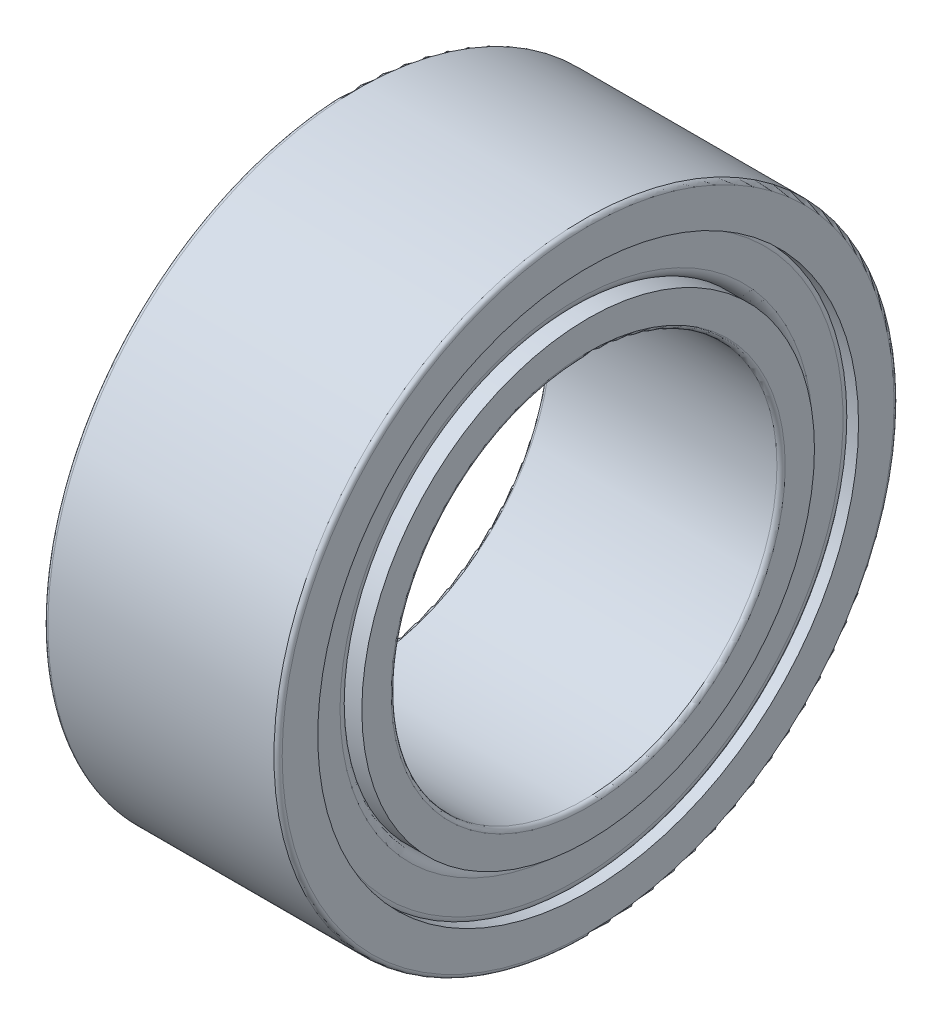
ISO-10303-21;
HEADER;
FILE_DESCRIPTION(('STEP AP214'),'2;1');
FILE_NAME('part.step','',(''),(''),'','','');
FILE_SCHEMA(('AUTOMOTIVE_DESIGN { 1 0 10303 214 1 1 1 1 }'));
ENDSEC;
DATA;
#1=APPLICATION_CONTEXT('core data for automotive mechanical design processes');
#2=APPLICATION_PROTOCOL_DEFINITION('international standard','automotive_design',2000,#1);
#3=PRODUCT_CONTEXT('',#1,'mechanical');
#4=PRODUCT('Part','Part','',(#3));
#5=PRODUCT_RELATED_PRODUCT_CATEGORY('part','',(#4));
#6=PRODUCT_DEFINITION_FORMATION('','',#4);
#7=PRODUCT_DEFINITION_CONTEXT('part definition',#1,'design');
#8=PRODUCT_DEFINITION('design','',#6,#7);
#9=PRODUCT_DEFINITION_SHAPE('','',#8);
#10=(LENGTH_UNIT() NAMED_UNIT(*) SI_UNIT(.MILLI.,.METRE.));
#11=(NAMED_UNIT(*) PLANE_ANGLE_UNIT() SI_UNIT($,.RADIAN.));
#12=(NAMED_UNIT(*) SI_UNIT($,.STERADIAN.) SOLID_ANGLE_UNIT());
#13=UNCERTAINTY_MEASURE_WITH_UNIT(LENGTH_MEASURE(1.E-05),#10,'distance_accuracy_value','');
#14=(GEOMETRIC_REPRESENTATION_CONTEXT(3) GLOBAL_UNCERTAINTY_ASSIGNED_CONTEXT((#13)) GLOBAL_UNIT_ASSIGNED_CONTEXT((#10,
#11,#12)) REPRESENTATION_CONTEXT('',''));
#15=CARTESIAN_POINT('',(0.,0.,0.));
#16=DIRECTION('',(0.,0.,1.));
#17=DIRECTION('',(1.,0.,0.));
#18=AXIS2_PLACEMENT_3D('',#15,#16,#17);
#19=CARTESIAN_POINT('',(-7.9375,0.,0.));
#20=DIRECTION('',(1.,0.,0.));
#21=DIRECTION('',(0.,0.,-1.));
#22=AXIS2_PLACEMENT_3D('',#19,#20,#21);
#23=CYLINDRICAL_SURFACE('',#22,20.0775);
#24=CARTESIAN_POINT('',(-7.65,0.,0.));
#25=DIRECTION('',(1.,0.,0.));
#26=DIRECTION('',(0.,0.,-1.));
#27=AXIS2_PLACEMENT_3D('',#24,#25,#26);
#28=CIRCLE('',#27,20.0775);
#29=CARTESIAN_POINT('',(-7.65,0.,-20.0775));
#30=VERTEX_POINT('',#29);
#31=EDGE_CURVE('E10',#30,#30,#28,.T.);
#32=ORIENTED_EDGE('',*,*,#31,.F.);
#33=EDGE_LOOP('',(#32));
#34=FACE_BOUND('',#33,.T.);
#35=CARTESIAN_POINT('',(-6.95702826179663,0.,0.));
#36=DIRECTION('',(1.,0.,0.));
#37=DIRECTION('',(0.,0.,-1.));
#38=AXIS2_PLACEMENT_3D('',#35,#36,#37);
#39=CIRCLE('',#38,20.0775);
#40=CARTESIAN_POINT('',(-6.95702826179663,0.,-20.0775));
#41=VERTEX_POINT('',#40);
#42=EDGE_CURVE('E40',#41,#41,#39,.T.);
#43=ORIENTED_EDGE('',*,*,#42,.T.);
#44=EDGE_LOOP('',(#43));
#45=FACE_BOUND('',#44,.T.);
#46=ADVANCED_FACE('F37',(#34,#45),#23,.F.);
#47=CARTESIAN_POINT('',(7.65,0.,0.));
#48=DIRECTION('',(1.,0.,0.));
#49=DIRECTION('',(0.,0.,-1.));
#50=AXIS2_PLACEMENT_3D('',#47,#48,#49);
#51=CIRCLE('',#50,20.0775);
#52=CARTESIAN_POINT('',(7.65,0.,-20.0775));
#53=VERTEX_POINT('',#52);
#54=EDGE_CURVE('E58',#53,#53,#51,.T.);
#55=ORIENTED_EDGE('',*,*,#54,.T.);
#56=EDGE_LOOP('',(#55));
#57=FACE_BOUND('',#56,.T.);
#58=CARTESIAN_POINT('',(6.95702826179665,0.,0.));
#59=DIRECTION('',(-1.,0.,0.));
#60=DIRECTION('',(0.,0.,1.));
#61=AXIS2_PLACEMENT_3D('',#58,#59,#60);
#62=CIRCLE('',#61,20.0775);
#63=CARTESIAN_POINT('',(6.95702826179665,0.,20.0775));
#64=VERTEX_POINT('',#63);
#65=EDGE_CURVE('E52',#64,#64,#62,.T.);
#66=ORIENTED_EDGE('',*,*,#65,.T.);
#67=EDGE_LOOP('',(#66));
#68=FACE_BOUND('',#67,.T.);
#69=ADVANCED_FACE('F105',(#57,#68),#23,.F.);
#70=CARTESIAN_POINT('',(-7.65,20.0775,0.));
#71=DIRECTION('',(1.,0.,0.));
#72=DIRECTION('',(0.,0.,-1.));
#73=AXIS2_PLACEMENT_3D('',#70,#71,#72);
#74=PLANE('',#73);
#75=ORIENTED_EDGE('',*,*,#31,.T.);
#76=EDGE_LOOP('',(#75));
#77=FACE_BOUND('',#76,.T.);
#78=CARTESIAN_POINT('',(-7.65,0.,0.));
#79=DIRECTION('',(1.,0.,0.));
#80=DIRECTION('',(0.,0.,-1.));
#81=AXIS2_PLACEMENT_3D('',#78,#79,#80);
#82=CIRCLE('',#81,19.620625);
#83=CARTESIAN_POINT('',(-7.65,0.,-19.620625));
#84=VERTEX_POINT('',#83);
#85=EDGE_CURVE('E44',#84,#84,#82,.T.);
#86=ORIENTED_EDGE('',*,*,#85,.F.);
#87=EDGE_LOOP('',(#86));
#88=FACE_BOUND('',#87,.T.);
#89=ADVANCED_FACE('F96',(#77,#88),#74,.T.);
#90=CARTESIAN_POINT('',(-7.9375,0.,0.));
#91=DIRECTION('',(1.,0.,0.));
#92=DIRECTION('',(0.,0.,-1.));
#93=AXIS2_PLACEMENT_3D('',#90,#91,#92);
#94=CYLINDRICAL_SURFACE('',#93,19.620625);
#95=ORIENTED_EDGE('',*,*,#85,.T.);
#96=EDGE_LOOP('',(#95));
#97=FACE_BOUND('',#96,.T.);
#98=CARTESIAN_POINT('',(-8.5,0.,0.));
#99=DIRECTION('',(1.,0.,0.));
#100=DIRECTION('',(0.,0.,-1.));
#101=AXIS2_PLACEMENT_3D('',#98,#99,#100);
#102=CIRCLE('',#101,19.620625);
#103=CARTESIAN_POINT('',(-8.5,0.,-19.620625));
#104=VERTEX_POINT('',#103);
#105=EDGE_CURVE('E49',#104,#104,#102,.T.);
#106=ORIENTED_EDGE('',*,*,#105,.F.);
#107=EDGE_LOOP('',(#106));
#108=FACE_BOUND('',#107,.T.);
#109=ADVANCED_FACE('F94',(#97,#108),#94,.F.);
#110=CARTESIAN_POINT('',(-8.5,19.620625,0.));
#111=DIRECTION('',(-1.,0.,0.));
#112=DIRECTION('',(0.,0.,1.));
#113=AXIS2_PLACEMENT_3D('',#110,#111,#112);
#114=PLANE('',#113);
#115=ORIENTED_EDGE('',*,*,#105,.T.);
#116=EDGE_LOOP('',(#115));
#117=FACE_BOUND('',#116,.T.);
#118=CARTESIAN_POINT('',(-8.5,0.,0.));
#119=DIRECTION('',(1.,0.,0.));
#120=DIRECTION('',(0.,0.,-1.));
#121=AXIS2_PLACEMENT_3D('',#118,#119,#120);
#122=CIRCLE('',#121,22.2);
#123=CARTESIAN_POINT('',(-8.5,0.,-22.2));
#124=VERTEX_POINT('',#123);
#125=EDGE_CURVE('E86',#124,#124,#122,.T.);
#126=ORIENTED_EDGE('',*,*,#125,.F.);
#127=EDGE_LOOP('',(#126));
#128=FACE_BOUND('',#127,.T.);
#129=ADVANCED_FACE('F91',(#117,#128),#114,.T.);
#130=CARTESIAN_POINT('',(-8.2,0.,0.));
#131=DIRECTION('',(1.,0.,0.));
#132=DIRECTION('',(0.,0.,-1.));
#133=AXIS2_PLACEMENT_3D('',#130,#131,#132);
#134=TOROIDAL_SURFACE('',#133,22.2,0.300000000000001);
#135=ORIENTED_EDGE('',*,*,#125,.T.);
#136=EDGE_LOOP('',(#135));
#137=FACE_BOUND('',#136,.T.);
#138=CARTESIAN_POINT('',(-8.2,0.,0.));
#139=DIRECTION('',(1.,0.,0.));
#140=DIRECTION('',(0.,0.,-1.));
#141=AXIS2_PLACEMENT_3D('',#138,#139,#140);
#142=CIRCLE('',#141,22.5);
#143=CARTESIAN_POINT('',(-8.2,0.,-22.5));
#144=VERTEX_POINT('',#143);
#145=EDGE_CURVE('E83',#144,#144,#142,.T.);
#146=ORIENTED_EDGE('',*,*,#145,.F.);
#147=EDGE_LOOP('',(#146));
#148=FACE_BOUND('',#147,.T.);
#149=ADVANCED_FACE('F103',(#137,#148),#134,.T.);
#150=CARTESIAN_POINT('',(-7.9375,0.,0.));
#151=DIRECTION('',(1.,0.,0.));
#152=DIRECTION('',(0.,0.,-1.));
#153=AXIS2_PLACEMENT_3D('',#150,#151,#152);
#154=CYLINDRICAL_SURFACE('',#153,22.5);
#155=ORIENTED_EDGE('',*,*,#145,.T.);
#156=EDGE_LOOP('',(#155));
#157=FACE_BOUND('',#156,.T.);
#158=CARTESIAN_POINT('',(8.2,0.,0.));
#159=DIRECTION('',(1.,0.,0.));
#160=DIRECTION('',(0.,0.,-1.));
#161=AXIS2_PLACEMENT_3D('',#158,#159,#160);
#162=CIRCLE('',#161,22.5);
#163=CARTESIAN_POINT('',(8.2,0.,-22.5));
#164=VERTEX_POINT('',#163);
#165=EDGE_CURVE('E80',#164,#164,#162,.T.);
#166=ORIENTED_EDGE('',*,*,#165,.F.);
#167=EDGE_LOOP('',(#166));
#168=FACE_BOUND('',#167,.T.);
#169=ADVANCED_FACE('F143',(#157,#168),#154,.T.);
#170=CARTESIAN_POINT('',(8.2,0.,0.));
#171=DIRECTION('',(1.,0.,0.));
#172=DIRECTION('',(0.,0.,-1.));
#173=AXIS2_PLACEMENT_3D('',#170,#171,#172);
#174=TOROIDAL_SURFACE('',#173,22.2,0.300000000000001);
#175=ORIENTED_EDGE('',*,*,#165,.T.);
#176=EDGE_LOOP('',(#175));
#177=FACE_BOUND('',#176,.T.);
#178=CARTESIAN_POINT('',(8.5,0.,0.));
#179=DIRECTION('',(1.,0.,0.));
#180=DIRECTION('',(0.,0.,-1.));
#181=AXIS2_PLACEMENT_3D('',#178,#179,#180);
#182=CIRCLE('',#181,22.2);
#183=CARTESIAN_POINT('',(8.5,0.,-22.2));
#184=VERTEX_POINT('',#183);
#185=EDGE_CURVE('E77',#184,#184,#182,.T.);
#186=ORIENTED_EDGE('',*,*,#185,.F.);
#187=EDGE_LOOP('',(#186));
#188=FACE_BOUND('',#187,.T.);
#189=ADVANCED_FACE('F139',(#177,#188),#174,.T.);
#190=CARTESIAN_POINT('',(8.5,22.2,0.));
#191=DIRECTION('',(1.,0.,0.));
#192=DIRECTION('',(0.,0.,-1.));
#193=AXIS2_PLACEMENT_3D('',#190,#191,#192);
#194=PLANE('',#193);
#195=ORIENTED_EDGE('',*,*,#185,.T.);
#196=EDGE_LOOP('',(#195));
#197=FACE_BOUND('',#196,.T.);
#198=CARTESIAN_POINT('',(8.5,0.,0.));
#199=DIRECTION('',(1.,0.,0.));
#200=DIRECTION('',(0.,0.,-1.));
#201=AXIS2_PLACEMENT_3D('',#198,#199,#200);
#202=CIRCLE('',#201,19.620625);
#203=CARTESIAN_POINT('',(8.5,0.,-19.620625));
#204=VERTEX_POINT('',#203);
#205=EDGE_CURVE('E74',#204,#204,#202,.T.);
#206=ORIENTED_EDGE('',*,*,#205,.F.);
#207=EDGE_LOOP('',(#206));
#208=FACE_BOUND('',#207,.T.);
#209=ADVANCED_FACE('F135',(#197,#208),#194,.T.);
#210=CARTESIAN_POINT('',(-7.9375,0.,0.));
#211=DIRECTION('',(1.,0.,0.));
#212=DIRECTION('',(0.,0.,-1.));
#213=AXIS2_PLACEMENT_3D('',#210,#211,#212);
#214=CYLINDRICAL_SURFACE('',#213,19.620625);
#215=ORIENTED_EDGE('',*,*,#205,.T.);
#216=EDGE_LOOP('',(#215));
#217=FACE_BOUND('',#216,.T.);
#218=CARTESIAN_POINT('',(7.65,0.,0.));
#219=DIRECTION('',(1.,0.,0.));
#220=DIRECTION('',(0.,0.,-1.));
#221=AXIS2_PLACEMENT_3D('',#218,#219,#220);
#222=CIRCLE('',#221,19.620625);
#223=CARTESIAN_POINT('',(7.65,0.,-19.620625));
#224=VERTEX_POINT('',#223);
#225=EDGE_CURVE('E71',#224,#224,#222,.T.);
#226=ORIENTED_EDGE('',*,*,#225,.F.);
#227=EDGE_LOOP('',(#226));
#228=FACE_BOUND('',#227,.T.);
#229=ADVANCED_FACE('F128',(#217,#228),#214,.F.);
#230=CARTESIAN_POINT('',(7.65,19.620625,0.));
#231=DIRECTION('',(-1.,0.,0.));
#232=DIRECTION('',(0.,0.,1.));
#233=AXIS2_PLACEMENT_3D('',#230,#231,#232);
#234=PLANE('',#233);
#235=ORIENTED_EDGE('',*,*,#225,.T.);
#236=EDGE_LOOP('',(#235));
#237=FACE_BOUND('',#236,.T.);
#238=ORIENTED_EDGE('',*,*,#54,.F.);
#239=EDGE_LOOP('',(#238));
#240=FACE_BOUND('',#239,.T.);
#241=ADVANCED_FACE('F120',(#237,#240),#234,.T.);
#242=CARTESIAN_POINT('',(-6.9188,0.,0.));
#243=DIRECTION('',(-1.,0.,0.));
#244=DIRECTION('',(0.,0.,1.));
#245=AXIS2_PLACEMENT_3D('',#242,#243,#244);
#246=TOROIDAL_SURFACE('',#245,19.3473,0.731200000000002);
#247=ORIENTED_EDGE('',*,*,#42,.F.);
#248=EDGE_LOOP('',(#247));
#249=FACE_BOUND('',#248,.T.);
#250=CARTESIAN_POINT('',(-7.65,0.,0.));
#251=DIRECTION('',(-1.,0.,0.));
#252=DIRECTION('',(0.,0.,1.));
#253=AXIS2_PLACEMENT_3D('',#250,#251,#252);
#254=CIRCLE('',#253,19.3473);
#255=CARTESIAN_POINT('',(-7.65,0.,19.3473));
#256=VERTEX_POINT('',#255);
#257=EDGE_CURVE('E54',#256,#256,#254,.T.);
#258=ORIENTED_EDGE('',*,*,#257,.F.);
#259=EDGE_LOOP('',(#258));
#260=FACE_BOUND('',#259,.T.);
#261=ADVANCED_FACE('F116',(#249,#260),#246,.T.);
#262=CARTESIAN_POINT('',(-7.65,19.3473,0.));
#263=DIRECTION('',(1.,0.,0.));
#264=DIRECTION('',(0.,0.,-1.));
#265=AXIS2_PLACEMENT_3D('',#262,#263,#264);
#266=PLANE('',#265);
#267=CARTESIAN_POINT('',(-7.65,0.,0.));
#268=DIRECTION('',(-1.,0.,0.));
#269=DIRECTION('',(0.,0.,1.));
#270=AXIS2_PLACEMENT_3D('',#267,#268,#269);
#271=CIRCLE('',#270,17.1537);
#272=CARTESIAN_POINT('',(-7.65,0.,17.1537));
#273=VERTEX_POINT('',#272);
#274=EDGE_CURVE('E60',#273,#273,#271,.T.);
#275=ORIENTED_EDGE('',*,*,#274,.F.);
#276=EDGE_LOOP('',(#275));
#277=FACE_BOUND('',#276,.T.);
#278=ORIENTED_EDGE('',*,*,#257,.T.);
#279=EDGE_LOOP('',(#278));
#280=FACE_BOUND('',#279,.T.);
#281=ADVANCED_FACE('F119',(#277,#280),#266,.F.);
#282=CARTESIAN_POINT('',(-6.9188,0.,0.));
#283=DIRECTION('',(-1.,0.,0.));
#284=DIRECTION('',(0.,0.,1.));
#285=AXIS2_PLACEMENT_3D('',#282,#283,#284);
#286=TOROIDAL_SURFACE('',#285,17.1537,0.731200000000002);
#287=CARTESIAN_POINT('',(-6.9188,0.,0.));
#288=DIRECTION('',(-1.,0.,0.));
#289=DIRECTION('',(0.,0.,1.));
#290=AXIS2_PLACEMENT_3D('',#287,#288,#289);
#291=CIRCLE('',#290,16.4225);
#292=CARTESIAN_POINT('',(-6.9188,0.,16.4225));
#293=VERTEX_POINT('',#292);
#294=EDGE_CURVE('E65',#293,#293,#291,.T.);
#295=ORIENTED_EDGE('',*,*,#294,.F.);
#296=EDGE_LOOP('',(#295));
#297=FACE_BOUND('',#296,.T.);
#298=ORIENTED_EDGE('',*,*,#274,.T.);
#299=EDGE_LOOP('',(#298));
#300=FACE_BOUND('',#299,.T.);
#301=ADVANCED_FACE('F125',(#297,#300),#286,.T.);
#302=CARTESIAN_POINT('',(6.9188,0.,0.));
#303=DIRECTION('',(-1.,0.,0.));
#304=DIRECTION('',(0.,0.,1.));
#305=AXIS2_PLACEMENT_3D('',#302,#303,#304);
#306=TOROIDAL_SURFACE('',#305,17.1537,0.731199999999999);
#307=CARTESIAN_POINT('',(7.65,0.,0.));
#308=DIRECTION('',(-1.,0.,0.));
#309=DIRECTION('',(0.,0.,1.));
#310=AXIS2_PLACEMENT_3D('',#307,#308,#309);
#311=CIRCLE('',#310,17.1537);
#312=CARTESIAN_POINT('',(7.65,0.,17.1537));
#313=VERTEX_POINT('',#312);
#314=EDGE_CURVE('E350',#313,#313,#311,.T.);
#315=ORIENTED_EDGE('',*,*,#314,.F.);
#316=EDGE_LOOP('',(#315));
#317=FACE_BOUND('',#316,.T.);
#318=CARTESIAN_POINT('',(6.9188,0.,0.));
#319=DIRECTION('',(1.,0.,0.));
#320=DIRECTION('',(0.,0.,-1.));
#321=AXIS2_PLACEMENT_3D('',#318,#319,#320);
#322=CIRCLE('',#321,16.4225);
#323=CARTESIAN_POINT('',(6.9188,0.,-16.4225));
#324=VERTEX_POINT('',#323);
#325=EDGE_CURVE('E344',#324,#324,#322,.T.);
#326=ORIENTED_EDGE('',*,*,#325,.F.);
#327=EDGE_LOOP('',(#326));
#328=FACE_BOUND('',#327,.T.);
#329=ADVANCED_FACE('F221',(#317,#328),#306,.T.);
#330=CARTESIAN_POINT('',(7.65,17.1537,0.));
#331=DIRECTION('',(-1.,0.,0.));
#332=DIRECTION('',(0.,0.,1.));
#333=AXIS2_PLACEMENT_3D('',#330,#331,#332);
#334=PLANE('',#333);
#335=CARTESIAN_POINT('',(7.65,0.,0.));
#336=DIRECTION('',(-1.,0.,0.));
#337=DIRECTION('',(0.,0.,1.));
#338=AXIS2_PLACEMENT_3D('',#335,#336,#337);
#339=CIRCLE('',#338,19.3473);
#340=CARTESIAN_POINT('',(7.65,0.,19.3473));
#341=VERTEX_POINT('',#340);
#342=EDGE_CURVE('E347',#341,#341,#339,.T.);
#343=ORIENTED_EDGE('',*,*,#342,.F.);
#344=EDGE_LOOP('',(#343));
#345=FACE_BOUND('',#344,.T.);
#346=ORIENTED_EDGE('',*,*,#314,.T.);
#347=EDGE_LOOP('',(#346));
#348=FACE_BOUND('',#347,.T.);
#349=ADVANCED_FACE('F230',(#345,#348),#334,.F.);
#350=CARTESIAN_POINT('',(6.9188,0.,0.));
#351=DIRECTION('',(-1.,0.,0.));
#352=DIRECTION('',(0.,0.,1.));
#353=AXIS2_PLACEMENT_3D('',#350,#351,#352);
#354=TOROIDAL_SURFACE('',#353,19.3473,0.731199999999999);
#355=ORIENTED_EDGE('',*,*,#65,.F.);
#356=EDGE_LOOP('',(#355));
#357=FACE_BOUND('',#356,.T.);
#358=ORIENTED_EDGE('',*,*,#342,.T.);
#359=EDGE_LOOP('',(#358));
#360=FACE_BOUND('',#359,.T.);
#361=ADVANCED_FACE('F240',(#357,#360),#354,.T.);
#362=CARTESIAN_POINT('',(-7.9375,0.,0.));
#363=DIRECTION('',(1.,0.,0.));
#364=DIRECTION('',(0.,0.,-1.));
#365=AXIS2_PLACEMENT_3D('',#362,#363,#364);
#366=CYLINDRICAL_SURFACE('',#365,16.4225);
#367=CARTESIAN_POINT('',(-8.5,0.,0.));
#368=DIRECTION('',(1.,0.,0.));
#369=DIRECTION('',(0.,0.,-1.));
#370=AXIS2_PLACEMENT_3D('',#367,#368,#369);
#371=CIRCLE('',#370,16.4225);
#372=CARTESIAN_POINT('',(-8.5,0.,-16.4225));
#373=VERTEX_POINT('',#372);
#374=EDGE_CURVE('E341',#373,#373,#371,.T.);
#375=ORIENTED_EDGE('',*,*,#374,.T.);
#376=EDGE_LOOP('',(#375));
#377=FACE_BOUND('',#376,.T.);
#378=ORIENTED_EDGE('',*,*,#294,.T.);
#379=EDGE_LOOP('',(#378));
#380=FACE_BOUND('',#379,.T.);
#381=ADVANCED_FACE('F250',(#377,#380),#366,.T.);
#382=ORIENTED_EDGE('',*,*,#325,.T.);
#383=EDGE_LOOP('',(#382));
#384=FACE_BOUND('',#383,.T.);
#385=CARTESIAN_POINT('',(8.5,0.,0.));
#386=DIRECTION('',(1.,0.,0.));
#387=DIRECTION('',(0.,0.,-1.));
#388=AXIS2_PLACEMENT_3D('',#385,#386,#387);
#389=CIRCLE('',#388,16.4225);
#390=CARTESIAN_POINT('',(8.5,0.,-16.4225));
#391=VERTEX_POINT('',#390);
#392=EDGE_CURVE('E325',#391,#391,#389,.T.);
#393=ORIENTED_EDGE('',*,*,#392,.F.);
#394=EDGE_LOOP('',(#393));
#395=FACE_BOUND('',#394,.T.);
#396=ADVANCED_FACE('F260',(#384,#395),#366,.T.);
#397=CARTESIAN_POINT('',(-8.5,16.4225,0.));
#398=DIRECTION('',(-1.,0.,0.));
#399=DIRECTION('',(0.,0.,1.));
#400=AXIS2_PLACEMENT_3D('',#397,#398,#399);
#401=PLANE('',#400);
#402=CARTESIAN_POINT('',(-8.5,0.,0.));
#403=DIRECTION('',(1.,0.,0.));
#404=DIRECTION('',(0.,0.,-1.));
#405=AXIS2_PLACEMENT_3D('',#402,#403,#404);
#406=CIRCLE('',#405,14.3);
#407=CARTESIAN_POINT('',(-8.5,0.,-14.3));
#408=VERTEX_POINT('',#407);
#409=EDGE_CURVE('E338',#408,#408,#406,.T.);
#410=ORIENTED_EDGE('',*,*,#409,.T.);
#411=EDGE_LOOP('',(#410));
#412=FACE_BOUND('',#411,.T.);
#413=ORIENTED_EDGE('',*,*,#374,.F.);
#414=EDGE_LOOP('',(#413));
#415=FACE_BOUND('',#414,.T.);
#416=ADVANCED_FACE('F270',(#412,#415),#401,.T.);
#417=CARTESIAN_POINT('',(-8.2,0.,0.));
#418=DIRECTION('',(1.,0.,0.));
#419=DIRECTION('',(0.,0.,-1.));
#420=AXIS2_PLACEMENT_3D('',#417,#418,#419);
#421=TOROIDAL_SURFACE('',#420,14.3,0.299999999999999);
#422=CARTESIAN_POINT('',(-8.2,0.,0.));
#423=DIRECTION('',(1.,0.,0.));
#424=DIRECTION('',(0.,0.,-1.));
#425=AXIS2_PLACEMENT_3D('',#422,#423,#424);
#426=CIRCLE('',#425,14.);
#427=CARTESIAN_POINT('',(-8.2,0.,-14.));
#428=VERTEX_POINT('',#427);
#429=EDGE_CURVE('E332',#428,#428,#426,.T.);
#430=ORIENTED_EDGE('',*,*,#429,.T.);
#431=EDGE_LOOP('',(#430));
#432=FACE_BOUND('',#431,.T.);
#433=ORIENTED_EDGE('',*,*,#409,.F.);
#434=EDGE_LOOP('',(#433));
#435=FACE_BOUND('',#434,.T.);
#436=ADVANCED_FACE('F279',(#432,#435),#421,.T.);
#437=CARTESIAN_POINT('',(-7.9375,0.,0.));
#438=DIRECTION('',(1.,0.,0.));
#439=DIRECTION('',(0.,0.,-1.));
#440=AXIS2_PLACEMENT_3D('',#437,#438,#439);
#441=CYLINDRICAL_SURFACE('',#440,14.);
#442=CARTESIAN_POINT('',(8.2,0.,0.));
#443=DIRECTION('',(1.,0.,0.));
#444=DIRECTION('',(0.,0.,-1.));
#445=AXIS2_PLACEMENT_3D('',#442,#443,#444);
#446=CIRCLE('',#445,14.);
#447=CARTESIAN_POINT('',(8.2,0.,-14.));
#448=VERTEX_POINT('',#447);
#449=EDGE_CURVE('E329',#448,#448,#446,.T.);
#450=ORIENTED_EDGE('',*,*,#449,.T.);
#451=EDGE_LOOP('',(#450));
#452=FACE_BOUND('',#451,.T.);
#453=ORIENTED_EDGE('',*,*,#429,.F.);
#454=EDGE_LOOP('',(#453));
#455=FACE_BOUND('',#454,.T.);
#456=ADVANCED_FACE('F289',(#452,#455),#441,.F.);
#457=CARTESIAN_POINT('',(8.2,0.,0.));
#458=DIRECTION('',(1.,0.,0.));
#459=DIRECTION('',(0.,0.,-1.));
#460=AXIS2_PLACEMENT_3D('',#457,#458,#459);
#461=TOROIDAL_SURFACE('',#460,14.3,0.300000000000001);
#462=CARTESIAN_POINT('',(8.5,0.,0.));
#463=DIRECTION('',(1.,0.,0.));
#464=DIRECTION('',(0.,0.,-1.));
#465=AXIS2_PLACEMENT_3D('',#462,#463,#464);
#466=CIRCLE('',#465,14.3);
#467=CARTESIAN_POINT('',(8.5,0.,-14.3));
#468=VERTEX_POINT('',#467);
#469=EDGE_CURVE('E328',#468,#468,#466,.T.);
#470=ORIENTED_EDGE('',*,*,#469,.T.);
#471=EDGE_LOOP('',(#470));
#472=FACE_BOUND('',#471,.T.);
#473=ORIENTED_EDGE('',*,*,#449,.F.);
#474=EDGE_LOOP('',(#473));
#475=FACE_BOUND('',#474,.T.);
#476=ADVANCED_FACE('F299',(#472,#475),#461,.T.);
#477=CARTESIAN_POINT('',(8.5,14.3,0.));
#478=DIRECTION('',(1.,0.,0.));
#479=DIRECTION('',(0.,0.,-1.));
#480=AXIS2_PLACEMENT_3D('',#477,#478,#479);
#481=PLANE('',#480);
#482=ORIENTED_EDGE('',*,*,#392,.T.);
#483=EDGE_LOOP('',(#482));
#484=FACE_BOUND('',#483,.T.);
#485=ORIENTED_EDGE('',*,*,#469,.F.);
#486=EDGE_LOOP('',(#485));
#487=FACE_BOUND('',#486,.T.);
#488=ADVANCED_FACE('F309',(#484,#487),#481,.T.);
#489=CLOSED_SHELL('',(#46,#69,#89,#109,#129,#149,#169,#189,#209,#229,#241,#261,#281,#301,#329,
#349,#361,#381,#396,#416,#436,#456,#476,#488));
#490=MANIFOLD_SOLID_BREP('B2',#489);
#491=ADVANCED_BREP_SHAPE_REPRESENTATION('',(#18,#490),#14);
#492=SHAPE_DEFINITION_REPRESENTATION(#9,#491);
ENDSEC;
END-ISO-10303-21;
